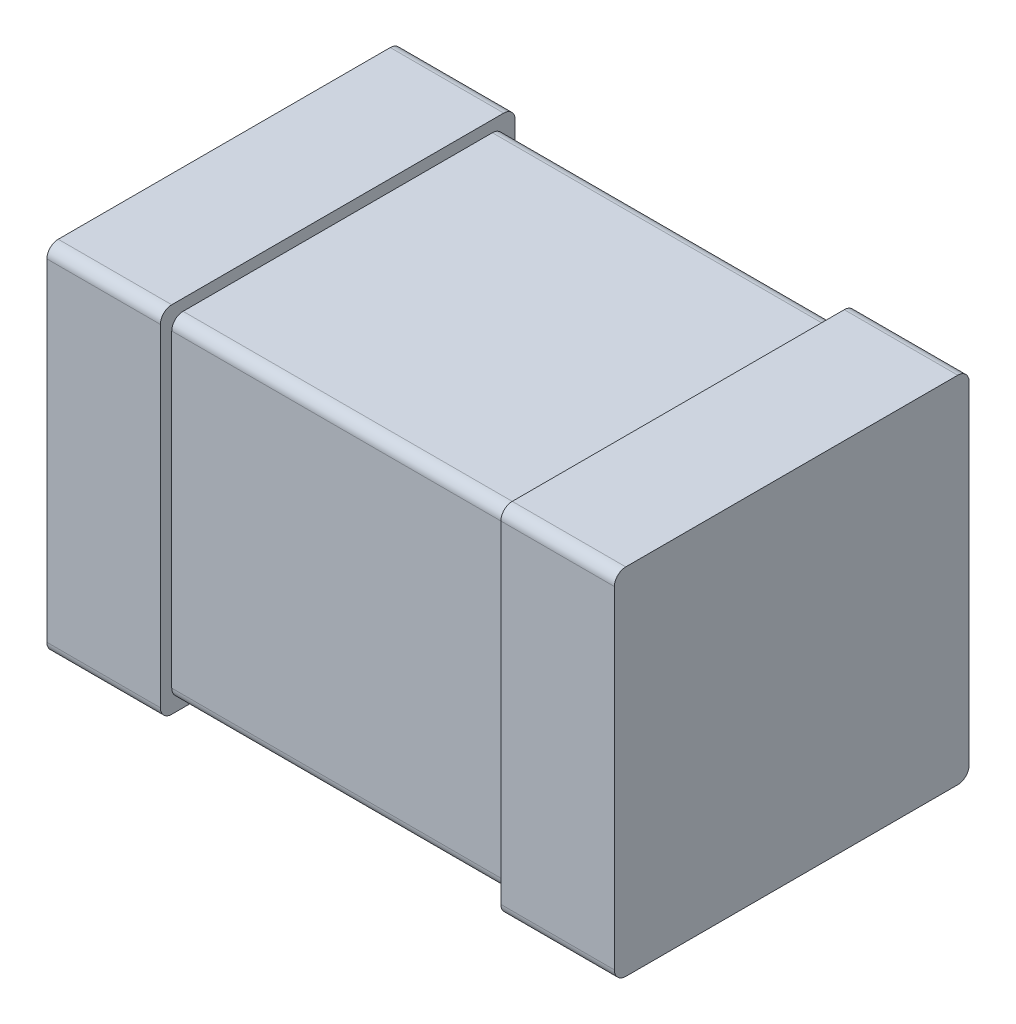
ISO-10303-21;
HEADER;
FILE_DESCRIPTION(('STEP AP214'),'2;1');
FILE_NAME('part.step','',(''),(''),'','','');
FILE_SCHEMA(('AUTOMOTIVE_DESIGN { 1 0 10303 214 1 1 1 1 }'));
ENDSEC;
DATA;
#1=APPLICATION_CONTEXT('core data for automotive mechanical design processes');
#2=APPLICATION_PROTOCOL_DEFINITION('international standard','automotive_design',2000,#1);
#3=PRODUCT_CONTEXT('',#1,'mechanical');
#4=PRODUCT('Part','Part','',(#3));
#5=PRODUCT_RELATED_PRODUCT_CATEGORY('part','',(#4));
#6=PRODUCT_DEFINITION_FORMATION('','',#4);
#7=PRODUCT_DEFINITION_CONTEXT('part definition',#1,'design');
#8=PRODUCT_DEFINITION('design','',#6,#7);
#9=PRODUCT_DEFINITION_SHAPE('','',#8);
#10=(LENGTH_UNIT() NAMED_UNIT(*) SI_UNIT(.MILLI.,.METRE.));
#11=(NAMED_UNIT(*) PLANE_ANGLE_UNIT() SI_UNIT($,.RADIAN.));
#12=(NAMED_UNIT(*) SI_UNIT($,.STERADIAN.) SOLID_ANGLE_UNIT());
#13=UNCERTAINTY_MEASURE_WITH_UNIT(LENGTH_MEASURE(1.E-05),#10,'distance_accuracy_value','');
#14=(GEOMETRIC_REPRESENTATION_CONTEXT(3) GLOBAL_UNCERTAINTY_ASSIGNED_CONTEXT((#13)) GLOBAL_UNIT_ASSIGNED_CONTEXT((#10,
#11,#12)) REPRESENTATION_CONTEXT('',''));
#15=CARTESIAN_POINT('',(0.,0.,0.));
#16=DIRECTION('',(0.,0.,1.));
#17=DIRECTION('',(1.,0.,0.));
#18=AXIS2_PLACEMENT_3D('',#15,#16,#17);
#19=CARTESIAN_POINT('',(1.,-0.625,0.));
#20=DIRECTION('',(1.,0.,0.));
#21=DIRECTION('',(0.,1.,0.));
#22=AXIS2_PLACEMENT_3D('',#19,#20,#21);
#23=PLANE('',#22);
#24=DIRECTION('',(0.,0.,1.));
#25=VECTOR('',#24,1.);
#26=CARTESIAN_POINT('',(1.,-0.625,0.));
#27=LINE('',#26,#25);
#28=CARTESIAN_POINT('',(1.,-0.625,0.04));
#29=VERTEX_POINT('',#28);
#30=CARTESIAN_POINT('',(1.,-0.625,1.21));
#31=VERTEX_POINT('',#30);
#32=EDGE_CURVE('E185',#29,#31,#27,.T.);
#33=ORIENTED_EDGE('',*,*,#32,.F.);
#34=CARTESIAN_POINT('',(1.,-0.585,0.04));
#35=DIRECTION('',(1.,0.,0.));
#36=DIRECTION('',(0.,0.,1.));
#37=AXIS2_PLACEMENT_3D('',#34,#35,#36);
#38=CIRCLE('',#37,0.04);
#39=CARTESIAN_POINT('',(1.,-0.585,0.));
#40=VERTEX_POINT('',#39);
#41=EDGE_CURVE('E173',#29,#40,#38,.T.);
#42=ORIENTED_EDGE('',*,*,#41,.T.);
#43=DIRECTION('',(0.,1.,0.));
#44=VECTOR('',#43,1.);
#45=CARTESIAN_POINT('',(1.,-0.625,0.));
#46=LINE('',#45,#44);
#47=CARTESIAN_POINT('',(1.,0.585,0.));
#48=VERTEX_POINT('',#47);
#49=EDGE_CURVE('E119',#40,#48,#46,.T.);
#50=ORIENTED_EDGE('',*,*,#49,.T.);
#51=CARTESIAN_POINT('',(1.,0.585,0.04));
#52=DIRECTION('',(-1.,0.,0.));
#53=DIRECTION('',(0.,0.,1.));
#54=AXIS2_PLACEMENT_3D('',#51,#52,#53);
#55=CIRCLE('',#54,0.04);
#56=CARTESIAN_POINT('',(1.,0.625,0.04));
#57=VERTEX_POINT('',#56);
#58=EDGE_CURVE('E103',#57,#48,#55,.T.);
#59=ORIENTED_EDGE('',*,*,#58,.F.);
#60=DIRECTION('',(0.,0.,1.));
#61=VECTOR('',#60,1.);
#62=CARTESIAN_POINT('',(1.,0.625,0.));
#63=LINE('',#62,#61);
#64=CARTESIAN_POINT('',(1.,0.625,1.21));
#65=VERTEX_POINT('',#64);
#66=EDGE_CURVE('E11',#57,#65,#63,.T.);
#67=ORIENTED_EDGE('',*,*,#66,.T.);
#68=CARTESIAN_POINT('',(1.,0.585,1.21));
#69=DIRECTION('',(1.,0.,0.));
#70=DIRECTION('',(0.,0.,1.));
#71=AXIS2_PLACEMENT_3D('',#68,#69,#70);
#72=CIRCLE('',#71,0.04);
#73=CARTESIAN_POINT('',(1.,0.585,1.25));
#74=VERTEX_POINT('',#73);
#75=EDGE_CURVE('E20',#65,#74,#72,.T.);
#76=ORIENTED_EDGE('',*,*,#75,.T.);
#77=DIRECTION('',(0.,1.,0.));
#78=VECTOR('',#77,1.);
#79=CARTESIAN_POINT('',(1.,-0.625,1.25));
#80=LINE('',#79,#78);
#81=CARTESIAN_POINT('',(1.,-0.585,1.25));
#82=VERTEX_POINT('',#81);
#83=EDGE_CURVE('E99',#82,#74,#80,.T.);
#84=ORIENTED_EDGE('',*,*,#83,.F.);
#85=CARTESIAN_POINT('',(1.,-0.585,1.21));
#86=DIRECTION('',(-1.,0.,0.));
#87=DIRECTION('',(0.,0.,1.));
#88=AXIS2_PLACEMENT_3D('',#85,#86,#87);
#89=CIRCLE('',#88,0.04);
#90=EDGE_CURVE('E170',#31,#82,#89,.T.);
#91=ORIENTED_EDGE('',*,*,#90,.F.);
#92=EDGE_LOOP('',(#33,#42,#50,#59,#67,#76,#84,#91));
#93=FACE_BOUND('',#92,.T.);
#94=ADVANCED_FACE('F17',(#93),#23,.T.);
#95=CARTESIAN_POINT('',(0.6,0.625,0.));
#96=DIRECTION('',(0.,1.,0.));
#97=DIRECTION('',(1.,0.,0.));
#98=AXIS2_PLACEMENT_3D('',#95,#96,#97);
#99=PLANE('',#98);
#100=ORIENTED_EDGE('',*,*,#66,.F.);
#101=DIRECTION('',(1.,0.,0.));
#102=VECTOR('',#101,1.);
#103=CARTESIAN_POINT('',(0.6,0.625,0.04));
#104=LINE('',#103,#102);
#105=CARTESIAN_POINT('',(0.6,0.625,0.04));
#106=VERTEX_POINT('',#105);
#107=EDGE_CURVE('E113',#106,#57,#104,.T.);
#108=ORIENTED_EDGE('',*,*,#107,.F.);
#109=DIRECTION('',(0.,0.,1.));
#110=VECTOR('',#109,1.);
#111=CARTESIAN_POINT('',(0.6,0.625,0.));
#112=LINE('',#111,#110);
#113=CARTESIAN_POINT('',(0.6,0.625,1.21));
#114=VERTEX_POINT('',#113);
#115=EDGE_CURVE('E156',#106,#114,#112,.T.);
#116=ORIENTED_EDGE('',*,*,#115,.T.);
#117=DIRECTION('',(1.,0.,0.));
#118=VECTOR('',#117,1.);
#119=CARTESIAN_POINT('',(0.6,0.625,1.21));
#120=LINE('',#119,#118);
#121=EDGE_CURVE('E27',#114,#65,#120,.T.);
#122=ORIENTED_EDGE('',*,*,#121,.T.);
#123=EDGE_LOOP('',(#100,#108,#116,#122));
#124=FACE_BOUND('',#123,.T.);
#125=ADVANCED_FACE('F584',(#124),#99,.T.);
#126=CARTESIAN_POINT('',(0.6,0.585,1.21));
#127=DIRECTION('',(1.,0.,0.));
#128=DIRECTION('',(0.,1.,0.));
#129=AXIS2_PLACEMENT_3D('',#126,#127,#128);
#130=CYLINDRICAL_SURFACE('',#129,0.04);
#131=CARTESIAN_POINT('',(0.6,0.585,1.21));
#132=DIRECTION('',(1.,0.,0.));
#133=DIRECTION('',(0.,0.,1.));
#134=AXIS2_PLACEMENT_3D('',#131,#132,#133);
#135=CIRCLE('',#134,0.04);
#136=CARTESIAN_POINT('',(0.6,0.585,1.25));
#137=VERTEX_POINT('',#136);
#138=EDGE_CURVE('E108',#114,#137,#135,.T.);
#139=ORIENTED_EDGE('',*,*,#138,.T.);
#140=DIRECTION('',(1.,0.,0.));
#141=VECTOR('',#140,1.);
#142=CARTESIAN_POINT('',(0.6,0.585,1.25));
#143=LINE('',#142,#141);
#144=EDGE_CURVE('E105',#137,#74,#143,.T.);
#145=ORIENTED_EDGE('',*,*,#144,.T.);
#146=ORIENTED_EDGE('',*,*,#75,.F.);
#147=ORIENTED_EDGE('',*,*,#121,.F.);
#148=EDGE_LOOP('',(#139,#145,#146,#147));
#149=FACE_BOUND('',#148,.T.);
#150=ADVANCED_FACE('F106',(#149),#130,.T.);
#151=CARTESIAN_POINT('',(0.6,0.585,0.04));
#152=DIRECTION('',(1.,0.,0.));
#153=DIRECTION('',(0.,1.,0.));
#154=AXIS2_PLACEMENT_3D('',#151,#152,#153);
#155=CYLINDRICAL_SURFACE('',#154,0.04);
#156=ORIENTED_EDGE('',*,*,#107,.T.);
#157=ORIENTED_EDGE('',*,*,#58,.T.);
#158=DIRECTION('',(1.,0.,0.));
#159=VECTOR('',#158,1.);
#160=CARTESIAN_POINT('',(0.6,0.585,0.));
#161=LINE('',#160,#159);
#162=CARTESIAN_POINT('',(0.6,0.585,0.));
#163=VERTEX_POINT('',#162);
#164=EDGE_CURVE('E126',#163,#48,#161,.T.);
#165=ORIENTED_EDGE('',*,*,#164,.F.);
#166=CARTESIAN_POINT('',(0.6,0.585,0.04));
#167=DIRECTION('',(-1.,0.,0.));
#168=DIRECTION('',(0.,0.,1.));
#169=AXIS2_PLACEMENT_3D('',#166,#167,#168);
#170=CIRCLE('',#169,0.04);
#171=EDGE_CURVE('E160',#106,#163,#170,.T.);
#172=ORIENTED_EDGE('',*,*,#171,.F.);
#173=EDGE_LOOP('',(#156,#157,#165,#172));
#174=FACE_BOUND('',#173,.T.);
#175=ADVANCED_FACE('F592',(#174),#155,.T.);
#176=CARTESIAN_POINT('',(0.6,-0.625,1.25));
#177=DIRECTION('',(0.,0.,1.));
#178=DIRECTION('',(1.,0.,0.));
#179=AXIS2_PLACEMENT_3D('',#176,#177,#178);
#180=PLANE('',#179);
#181=DIRECTION('',(0.,1.,0.));
#182=VECTOR('',#181,1.);
#183=CARTESIAN_POINT('',(0.6,-0.625,1.25));
#184=LINE('',#183,#182);
#185=CARTESIAN_POINT('',(0.6,-0.585,1.25));
#186=VERTEX_POINT('',#185);
#187=EDGE_CURVE('E267',#186,#137,#184,.T.);
#188=ORIENTED_EDGE('',*,*,#187,.F.);
#189=DIRECTION('',(1.,0.,0.));
#190=VECTOR('',#189,1.);
#191=CARTESIAN_POINT('',(0.6,-0.585,1.25));
#192=LINE('',#191,#190);
#193=EDGE_CURVE('E116',#186,#82,#192,.T.);
#194=ORIENTED_EDGE('',*,*,#193,.T.);
#195=ORIENTED_EDGE('',*,*,#83,.T.);
#196=ORIENTED_EDGE('',*,*,#144,.F.);
#197=EDGE_LOOP('',(#188,#194,#195,#196));
#198=FACE_BOUND('',#197,.T.);
#199=ADVANCED_FACE('F115',(#198),#180,.T.);
#200=CARTESIAN_POINT('',(0.6,-0.625,0.));
#201=DIRECTION('',(0.,0.,1.));
#202=DIRECTION('',(1.,0.,0.));
#203=AXIS2_PLACEMENT_3D('',#200,#201,#202);
#204=PLANE('',#203);
#205=ORIENTED_EDGE('',*,*,#164,.T.);
#206=ORIENTED_EDGE('',*,*,#49,.F.);
#207=DIRECTION('',(1.,0.,0.));
#208=VECTOR('',#207,1.);
#209=CARTESIAN_POINT('',(0.6,-0.585,0.));
#210=LINE('',#209,#208);
#211=CARTESIAN_POINT('',(0.6,-0.585,0.));
#212=VERTEX_POINT('',#211);
#213=EDGE_CURVE('E189',#212,#40,#210,.T.);
#214=ORIENTED_EDGE('',*,*,#213,.F.);
#215=DIRECTION('',(0.,1.,0.));
#216=VECTOR('',#215,1.);
#217=CARTESIAN_POINT('',(0.6,-0.625,0.));
#218=LINE('',#217,#216);
#219=EDGE_CURVE('E161',#212,#163,#218,.T.);
#220=ORIENTED_EDGE('',*,*,#219,.T.);
#221=EDGE_LOOP('',(#205,#206,#214,#220));
#222=FACE_BOUND('',#221,.T.);
#223=ADVANCED_FACE('F597',(#222),#204,.F.);
#224=CARTESIAN_POINT('',(0.6,-0.585,1.21));
#225=DIRECTION('',(1.,0.,0.));
#226=DIRECTION('',(0.,-1.,0.));
#227=AXIS2_PLACEMENT_3D('',#224,#225,#226);
#228=CYLINDRICAL_SURFACE('',#227,0.04);
#229=DIRECTION('',(1.,0.,0.));
#230=VECTOR('',#229,1.);
#231=CARTESIAN_POINT('',(0.6,-0.625,1.21));
#232=LINE('',#231,#230);
#233=CARTESIAN_POINT('',(0.6,-0.625,1.21));
#234=VERTEX_POINT('',#233);
#235=EDGE_CURVE('E177',#234,#31,#232,.T.);
#236=ORIENTED_EDGE('',*,*,#235,.T.);
#237=ORIENTED_EDGE('',*,*,#90,.T.);
#238=ORIENTED_EDGE('',*,*,#193,.F.);
#239=CARTESIAN_POINT('',(0.6,-0.585,1.21));
#240=DIRECTION('',(-1.,0.,0.));
#241=DIRECTION('',(0.,0.,1.));
#242=AXIS2_PLACEMENT_3D('',#239,#240,#241);
#243=CIRCLE('',#242,0.04);
#244=EDGE_CURVE('E215',#234,#186,#243,.T.);
#245=ORIENTED_EDGE('',*,*,#244,.F.);
#246=EDGE_LOOP('',(#236,#237,#238,#245));
#247=FACE_BOUND('',#246,.T.);
#248=ADVANCED_FACE('F604',(#247),#228,.T.);
#249=CARTESIAN_POINT('',(0.6,-0.585,0.04));
#250=DIRECTION('',(1.,0.,0.));
#251=DIRECTION('',(0.,-1.,0.));
#252=AXIS2_PLACEMENT_3D('',#249,#250,#251);
#253=CYLINDRICAL_SURFACE('',#252,0.04);
#254=CARTESIAN_POINT('',(0.6,-0.585,0.04));
#255=DIRECTION('',(1.,0.,0.));
#256=DIRECTION('',(0.,0.,1.));
#257=AXIS2_PLACEMENT_3D('',#254,#255,#256);
#258=CIRCLE('',#257,0.04);
#259=CARTESIAN_POINT('',(0.6,-0.625,0.04));
#260=VERTEX_POINT('',#259);
#261=EDGE_CURVE('E165',#260,#212,#258,.T.);
#262=ORIENTED_EDGE('',*,*,#261,.T.);
#263=ORIENTED_EDGE('',*,*,#213,.T.);
#264=ORIENTED_EDGE('',*,*,#41,.F.);
#265=DIRECTION('',(1.,0.,0.));
#266=VECTOR('',#265,1.);
#267=CARTESIAN_POINT('',(0.6,-0.625,0.04));
#268=LINE('',#267,#266);
#269=EDGE_CURVE('E181',#260,#29,#268,.T.);
#270=ORIENTED_EDGE('',*,*,#269,.F.);
#271=EDGE_LOOP('',(#262,#263,#264,#270));
#272=FACE_BOUND('',#271,.T.);
#273=ADVANCED_FACE('F600',(#272),#253,.T.);
#274=CARTESIAN_POINT('',(0.6,-0.625,0.));
#275=DIRECTION('',(0.,1.,0.));
#276=DIRECTION('',(1.,0.,0.));
#277=AXIS2_PLACEMENT_3D('',#274,#275,#276);
#278=PLANE('',#277);
#279=ORIENTED_EDGE('',*,*,#235,.F.);
#280=DIRECTION('',(0.,0.,1.));
#281=VECTOR('',#280,1.);
#282=CARTESIAN_POINT('',(0.6,-0.625,0.));
#283=LINE('',#282,#281);
#284=EDGE_CURVE('E169',#260,#234,#283,.T.);
#285=ORIENTED_EDGE('',*,*,#284,.F.);
#286=ORIENTED_EDGE('',*,*,#269,.T.);
#287=ORIENTED_EDGE('',*,*,#32,.T.);
#288=EDGE_LOOP('',(#279,#285,#286,#287));
#289=FACE_BOUND('',#288,.T.);
#290=ADVANCED_FACE('F603',(#289),#278,.F.);
#291=CARTESIAN_POINT('',(0.6,-0.625,0.));
#292=DIRECTION('',(1.,0.,0.));
#293=DIRECTION('',(0.,1.,0.));
#294=AXIS2_PLACEMENT_3D('',#291,#292,#293);
#295=PLANE('',#294);
#296=DIRECTION('',(0.,1.,0.));
#297=VECTOR('',#296,1.);
#298=CARTESIAN_POINT('',(0.6,-0.585,0.04));
#299=LINE('',#298,#297);
#300=CARTESIAN_POINT('',(0.6,-0.545,0.04));
#301=VERTEX_POINT('',#300);
#302=CARTESIAN_POINT('',(0.6,0.545,0.04));
#303=VERTEX_POINT('',#302);
#304=EDGE_CURVE('E130',#301,#303,#299,.T.);
#305=ORIENTED_EDGE('',*,*,#304,.T.);
#306=CARTESIAN_POINT('',(0.6,0.545,0.08));
#307=DIRECTION('',(-1.,0.,0.));
#308=DIRECTION('',(0.,0.,1.));
#309=AXIS2_PLACEMENT_3D('',#306,#307,#308);
#310=CIRCLE('',#309,0.04);
#311=CARTESIAN_POINT('',(0.6,0.585,0.08));
#312=VERTEX_POINT('',#311);
#313=EDGE_CURVE('E135',#312,#303,#310,.T.);
#314=ORIENTED_EDGE('',*,*,#313,.F.);
#315=DIRECTION('',(0.,0.,1.));
#316=VECTOR('',#315,1.);
#317=CARTESIAN_POINT('',(0.6,0.585,0.04));
#318=LINE('',#317,#316);
#319=CARTESIAN_POINT('',(0.6,0.585,1.17));
#320=VERTEX_POINT('',#319);
#321=EDGE_CURVE('E233',#312,#320,#318,.T.);
#322=ORIENTED_EDGE('',*,*,#321,.T.);
#323=CARTESIAN_POINT('',(0.6,0.545,1.17));
#324=DIRECTION('',(1.,0.,0.));
#325=DIRECTION('',(0.,0.,1.));
#326=AXIS2_PLACEMENT_3D('',#323,#324,#325);
#327=CIRCLE('',#326,0.04);
#328=CARTESIAN_POINT('',(0.6,0.545,1.21));
#329=VERTEX_POINT('',#328);
#330=EDGE_CURVE('E140',#320,#329,#327,.T.);
#331=ORIENTED_EDGE('',*,*,#330,.T.);
#332=DIRECTION('',(0.,1.,0.));
#333=VECTOR('',#332,1.);
#334=CARTESIAN_POINT('',(0.6,-0.585,1.21));
#335=LINE('',#334,#333);
#336=CARTESIAN_POINT('',(0.6,-0.545,1.21));
#337=VERTEX_POINT('',#336);
#338=EDGE_CURVE('E142',#337,#329,#335,.T.);
#339=ORIENTED_EDGE('',*,*,#338,.F.);
#340=CARTESIAN_POINT('',(0.6,-0.545,1.17));
#341=DIRECTION('',(-1.,0.,0.));
#342=DIRECTION('',(0.,0.,1.));
#343=AXIS2_PLACEMENT_3D('',#340,#341,#342);
#344=CIRCLE('',#343,0.04);
#345=CARTESIAN_POINT('',(0.6,-0.585,1.17));
#346=VERTEX_POINT('',#345);
#347=EDGE_CURVE('E151',#346,#337,#344,.T.);
#348=ORIENTED_EDGE('',*,*,#347,.F.);
#349=DIRECTION('',(0.,0.,1.));
#350=VECTOR('',#349,1.);
#351=CARTESIAN_POINT('',(0.6,-0.585,0.04));
#352=LINE('',#351,#350);
#353=CARTESIAN_POINT('',(0.6,-0.585,0.08));
#354=VERTEX_POINT('',#353);
#355=EDGE_CURVE('E155',#354,#346,#352,.T.);
#356=ORIENTED_EDGE('',*,*,#355,.F.);
#357=CARTESIAN_POINT('',(0.6,-0.545,0.08));
#358=DIRECTION('',(1.,0.,0.));
#359=DIRECTION('',(0.,0.,1.));
#360=AXIS2_PLACEMENT_3D('',#357,#358,#359);
#361=CIRCLE('',#360,0.04);
#362=EDGE_CURVE('E283',#354,#301,#361,.T.);
#363=ORIENTED_EDGE('',*,*,#362,.T.);
#364=EDGE_LOOP('',(#305,#314,#322,#331,#339,#348,#356,#363));
#365=FACE_BOUND('',#364,.T.);
#366=ORIENTED_EDGE('',*,*,#244,.T.);
#367=ORIENTED_EDGE('',*,*,#187,.T.);
#368=ORIENTED_EDGE('',*,*,#138,.F.);
#369=ORIENTED_EDGE('',*,*,#115,.F.);
#370=ORIENTED_EDGE('',*,*,#171,.T.);
#371=ORIENTED_EDGE('',*,*,#219,.F.);
#372=ORIENTED_EDGE('',*,*,#261,.F.);
#373=ORIENTED_EDGE('',*,*,#284,.T.);
#374=EDGE_LOOP('',(#366,#367,#368,#369,#370,#371,#372,#373));
#375=FACE_BOUND('',#374,.T.);
#376=ADVANCED_FACE('F313',(#365,#375),#295,.F.);
#377=CARTESIAN_POINT('',(-0.6,-0.585,0.04));
#378=DIRECTION('',(0.,1.,0.));
#379=DIRECTION('',(1.,0.,0.));
#380=AXIS2_PLACEMENT_3D('',#377,#378,#379);
#381=PLANE('',#380);
#382=DIRECTION('',(1.,0.,0.));
#383=VECTOR('',#382,1.);
#384=CARTESIAN_POINT('',(-0.6,-0.585,1.17));
#385=LINE('',#384,#383);
#386=CARTESIAN_POINT('',(-0.6,-0.585,1.17));
#387=VERTEX_POINT('',#386);
#388=EDGE_CURVE('E146',#387,#346,#385,.T.);
#389=ORIENTED_EDGE('',*,*,#388,.F.);
#390=DIRECTION('',(0.,0.,1.));
#391=VECTOR('',#390,1.);
#392=CARTESIAN_POINT('',(-0.6,-0.585,0.04));
#393=LINE('',#392,#391);
#394=CARTESIAN_POINT('',(-0.6,-0.585,0.08));
#395=VERTEX_POINT('',#394);
#396=EDGE_CURVE('E253',#395,#387,#393,.T.);
#397=ORIENTED_EDGE('',*,*,#396,.F.);
#398=DIRECTION('',(1.,0.,0.));
#399=VECTOR('',#398,1.);
#400=CARTESIAN_POINT('',(-0.6,-0.585,0.08));
#401=LINE('',#400,#399);
#402=EDGE_CURVE('E284',#395,#354,#401,.T.);
#403=ORIENTED_EDGE('',*,*,#402,.T.);
#404=ORIENTED_EDGE('',*,*,#355,.T.);
#405=EDGE_LOOP('',(#389,#397,#403,#404));
#406=FACE_BOUND('',#405,.T.);
#407=ADVANCED_FACE('F431',(#406),#381,.F.);
#408=CARTESIAN_POINT('',(-0.6,-0.545,1.17));
#409=DIRECTION('',(1.,0.,0.));
#410=DIRECTION('',(0.,-1.,0.));
#411=AXIS2_PLACEMENT_3D('',#408,#409,#410);
#412=CYLINDRICAL_SURFACE('',#411,0.04);
#413=ORIENTED_EDGE('',*,*,#388,.T.);
#414=ORIENTED_EDGE('',*,*,#347,.T.);
#415=DIRECTION('',(1.,0.,0.));
#416=VECTOR('',#415,1.);
#417=CARTESIAN_POINT('',(-0.6,-0.545,1.21));
#418=LINE('',#417,#416);
#419=CARTESIAN_POINT('',(-0.6,-0.545,1.21));
#420=VERTEX_POINT('',#419);
#421=EDGE_CURVE('E147',#420,#337,#418,.T.);
#422=ORIENTED_EDGE('',*,*,#421,.F.);
#423=CARTESIAN_POINT('',(-0.6,-0.545,1.17));
#424=DIRECTION('',(-1.,0.,0.));
#425=DIRECTION('',(0.,0.,1.));
#426=AXIS2_PLACEMENT_3D('',#423,#424,#425);
#427=CIRCLE('',#426,0.04);
#428=EDGE_CURVE('E257',#387,#420,#427,.T.);
#429=ORIENTED_EDGE('',*,*,#428,.F.);
#430=EDGE_LOOP('',(#413,#414,#422,#429));
#431=FACE_BOUND('',#430,.T.);
#432=ADVANCED_FACE('F429',(#431),#412,.T.);
#433=CARTESIAN_POINT('',(-0.6,-0.585,1.21));
#434=DIRECTION('',(0.,0.,1.));
#435=DIRECTION('',(1.,0.,0.));
#436=AXIS2_PLACEMENT_3D('',#433,#434,#435);
#437=PLANE('',#436);
#438=DIRECTION('',(0.,1.,0.));
#439=VECTOR('',#438,1.);
#440=CARTESIAN_POINT('',(-0.6,-0.585,1.21));
#441=LINE('',#440,#439);
#442=CARTESIAN_POINT('',(-0.6,0.545,1.21));
#443=VERTEX_POINT('',#442);
#444=EDGE_CURVE('E246',#420,#443,#441,.T.);
#445=ORIENTED_EDGE('',*,*,#444,.F.);
#446=ORIENTED_EDGE('',*,*,#421,.T.);
#447=ORIENTED_EDGE('',*,*,#338,.T.);
#448=DIRECTION('',(1.,0.,0.));
#449=VECTOR('',#448,1.);
#450=CARTESIAN_POINT('',(-0.6,0.545,1.21));
#451=LINE('',#450,#449);
#452=EDGE_CURVE('E136',#443,#329,#451,.T.);
#453=ORIENTED_EDGE('',*,*,#452,.F.);
#454=EDGE_LOOP('',(#445,#446,#447,#453));
#455=FACE_BOUND('',#454,.T.);
#456=ADVANCED_FACE('F423',(#455),#437,.T.);
#457=CARTESIAN_POINT('',(-0.6,0.545,1.17));
#458=DIRECTION('',(1.,0.,0.));
#459=DIRECTION('',(0.,1.,0.));
#460=AXIS2_PLACEMENT_3D('',#457,#458,#459);
#461=CYLINDRICAL_SURFACE('',#460,0.04);
#462=CARTESIAN_POINT('',(-0.6,0.545,1.17));
#463=DIRECTION('',(1.,0.,0.));
#464=DIRECTION('',(0.,0.,1.));
#465=AXIS2_PLACEMENT_3D('',#462,#463,#464);
#466=CIRCLE('',#465,0.04);
#467=CARTESIAN_POINT('',(-0.6,0.585,1.17));
#468=VERTEX_POINT('',#467);
#469=EDGE_CURVE('E241',#468,#443,#466,.T.);
#470=ORIENTED_EDGE('',*,*,#469,.T.);
#471=ORIENTED_EDGE('',*,*,#452,.T.);
#472=ORIENTED_EDGE('',*,*,#330,.F.);
#473=DIRECTION('',(1.,0.,0.));
#474=VECTOR('',#473,1.);
#475=CARTESIAN_POINT('',(-0.6,0.585,1.17));
#476=LINE('',#475,#474);
#477=EDGE_CURVE('E141',#468,#320,#476,.T.);
#478=ORIENTED_EDGE('',*,*,#477,.F.);
#479=EDGE_LOOP('',(#470,#471,#472,#478));
#480=FACE_BOUND('',#479,.T.);
#481=ADVANCED_FACE('F425',(#480),#461,.T.);
#482=CARTESIAN_POINT('',(-0.6,0.585,0.04));
#483=DIRECTION('',(0.,1.,0.));
#484=DIRECTION('',(1.,0.,0.));
#485=AXIS2_PLACEMENT_3D('',#482,#483,#484);
#486=PLANE('',#485);
#487=ORIENTED_EDGE('',*,*,#321,.F.);
#488=DIRECTION('',(1.,0.,0.));
#489=VECTOR('',#488,1.);
#490=CARTESIAN_POINT('',(-0.6,0.585,0.08));
#491=LINE('',#490,#489);
#492=CARTESIAN_POINT('',(-0.6,0.585,0.08));
#493=VERTEX_POINT('',#492);
#494=EDGE_CURVE('E132',#493,#312,#491,.T.);
#495=ORIENTED_EDGE('',*,*,#494,.F.);
#496=DIRECTION('',(0.,0.,1.));
#497=VECTOR('',#496,1.);
#498=CARTESIAN_POINT('',(-0.6,0.585,0.04));
#499=LINE('',#498,#497);
#500=EDGE_CURVE('E245',#493,#468,#499,.T.);
#501=ORIENTED_EDGE('',*,*,#500,.T.);
#502=ORIENTED_EDGE('',*,*,#477,.T.);
#503=EDGE_LOOP('',(#487,#495,#501,#502));
#504=FACE_BOUND('',#503,.T.);
#505=ADVANCED_FACE('F617',(#504),#486,.T.);
#506=CARTESIAN_POINT('',(-0.6,0.545,0.08));
#507=DIRECTION('',(1.,0.,0.));
#508=DIRECTION('',(0.,1.,0.));
#509=AXIS2_PLACEMENT_3D('',#506,#507,#508);
#510=CYLINDRICAL_SURFACE('',#509,0.04);
#511=ORIENTED_EDGE('',*,*,#494,.T.);
#512=ORIENTED_EDGE('',*,*,#313,.T.);
#513=DIRECTION('',(1.,0.,0.));
#514=VECTOR('',#513,1.);
#515=CARTESIAN_POINT('',(-0.6,0.545,0.04));
#516=LINE('',#515,#514);
#517=CARTESIAN_POINT('',(-0.6,0.545,0.04));
#518=VERTEX_POINT('',#517);
#519=EDGE_CURVE('E288',#518,#303,#516,.T.);
#520=ORIENTED_EDGE('',*,*,#519,.F.);
#521=CARTESIAN_POINT('',(-0.6,0.545,0.08));
#522=DIRECTION('',(-1.,0.,0.));
#523=DIRECTION('',(0.,0.,1.));
#524=AXIS2_PLACEMENT_3D('',#521,#522,#523);
#525=CIRCLE('',#524,0.04);
#526=EDGE_CURVE('E271',#493,#518,#525,.T.);
#527=ORIENTED_EDGE('',*,*,#526,.F.);
#528=EDGE_LOOP('',(#511,#512,#520,#527));
#529=FACE_BOUND('',#528,.T.);
#530=ADVANCED_FACE('F302',(#529),#510,.T.);
#531=CARTESIAN_POINT('',(-0.6,-0.585,0.04));
#532=DIRECTION('',(0.,0.,1.));
#533=DIRECTION('',(1.,0.,0.));
#534=AXIS2_PLACEMENT_3D('',#531,#532,#533);
#535=PLANE('',#534);
#536=ORIENTED_EDGE('',*,*,#519,.T.);
#537=ORIENTED_EDGE('',*,*,#304,.F.);
#538=DIRECTION('',(1.,0.,0.));
#539=VECTOR('',#538,1.);
#540=CARTESIAN_POINT('',(-0.6,-0.545,0.04));
#541=LINE('',#540,#539);
#542=CARTESIAN_POINT('',(-0.6,-0.545,0.04));
#543=VERTEX_POINT('',#542);
#544=EDGE_CURVE('E279',#543,#301,#541,.T.);
#545=ORIENTED_EDGE('',*,*,#544,.F.);
#546=DIRECTION('',(0.,1.,0.));
#547=VECTOR('',#546,1.);
#548=CARTESIAN_POINT('',(-0.6,-0.585,0.04));
#549=LINE('',#548,#547);
#550=EDGE_CURVE('E275',#543,#518,#549,.T.);
#551=ORIENTED_EDGE('',*,*,#550,.T.);
#552=EDGE_LOOP('',(#536,#537,#545,#551));
#553=FACE_BOUND('',#552,.T.);
#554=ADVANCED_FACE('F320',(#553),#535,.F.);
#555=CARTESIAN_POINT('',(-0.6,-0.545,0.08));
#556=DIRECTION('',(1.,0.,0.));
#557=DIRECTION('',(0.,-1.,0.));
#558=AXIS2_PLACEMENT_3D('',#555,#556,#557);
#559=CYLINDRICAL_SURFACE('',#558,0.04);
#560=CARTESIAN_POINT('',(-0.6,-0.545,0.08));
#561=DIRECTION('',(1.,0.,0.));
#562=DIRECTION('',(0.,0.,1.));
#563=AXIS2_PLACEMENT_3D('',#560,#561,#562);
#564=CIRCLE('',#563,0.04);
#565=EDGE_CURVE('E258',#395,#543,#564,.T.);
#566=ORIENTED_EDGE('',*,*,#565,.T.);
#567=ORIENTED_EDGE('',*,*,#544,.T.);
#568=ORIENTED_EDGE('',*,*,#362,.F.);
#569=ORIENTED_EDGE('',*,*,#402,.F.);
#570=EDGE_LOOP('',(#566,#567,#568,#569));
#571=FACE_BOUND('',#570,.T.);
#572=ADVANCED_FACE('F627',(#571),#559,.T.);
#573=CARTESIAN_POINT('',(-0.6,-0.625,0.));
#574=DIRECTION('',(1.,0.,0.));
#575=DIRECTION('',(0.,1.,0.));
#576=AXIS2_PLACEMENT_3D('',#573,#574,#575);
#577=PLANE('',#576);
#578=ORIENTED_EDGE('',*,*,#565,.F.);
#579=ORIENTED_EDGE('',*,*,#396,.T.);
#580=ORIENTED_EDGE('',*,*,#428,.T.);
#581=ORIENTED_EDGE('',*,*,#444,.T.);
#582=ORIENTED_EDGE('',*,*,#469,.F.);
#583=ORIENTED_EDGE('',*,*,#500,.F.);
#584=ORIENTED_EDGE('',*,*,#526,.T.);
#585=ORIENTED_EDGE('',*,*,#550,.F.);
#586=EDGE_LOOP('',(#578,#579,#580,#581,#582,#583,#584,#585));
#587=FACE_BOUND('',#586,.T.);
#588=DIRECTION('',(0.,0.,1.));
#589=VECTOR('',#588,1.);
#590=CARTESIAN_POINT('',(-0.6,-0.625,0.));
#591=LINE('',#590,#589);
#592=CARTESIAN_POINT('',(-0.6,-0.625,0.04));
#593=VERTEX_POINT('',#592);
#594=CARTESIAN_POINT('',(-0.6,-0.625,1.21));
#595=VERTEX_POINT('',#594);
#596=EDGE_CURVE('E448',#593,#595,#591,.T.);
#597=ORIENTED_EDGE('',*,*,#596,.F.);
#598=CARTESIAN_POINT('',(-0.6,-0.585,0.04));
#599=DIRECTION('',(1.,0.,0.));
#600=DIRECTION('',(0.,0.,1.));
#601=AXIS2_PLACEMENT_3D('',#598,#599,#600);
#602=CIRCLE('',#601,0.04);
#603=CARTESIAN_POINT('',(-0.6,-0.585,0.));
#604=VERTEX_POINT('',#603);
#605=EDGE_CURVE('E447',#593,#604,#602,.T.);
#606=ORIENTED_EDGE('',*,*,#605,.T.);
#607=DIRECTION('',(0.,1.,0.));
#608=VECTOR('',#607,1.);
#609=CARTESIAN_POINT('',(-0.6,-0.625,0.));
#610=LINE('',#609,#608);
#611=CARTESIAN_POINT('',(-0.6,0.585,0.));
#612=VERTEX_POINT('',#611);
#613=EDGE_CURVE('E211',#604,#612,#610,.T.);
#614=ORIENTED_EDGE('',*,*,#613,.T.);
#615=CARTESIAN_POINT('',(-0.6,0.585,0.04));
#616=DIRECTION('',(-1.,0.,0.));
#617=DIRECTION('',(0.,0.,1.));
#618=AXIS2_PLACEMENT_3D('',#615,#616,#617);
#619=CIRCLE('',#618,0.04);
#620=CARTESIAN_POINT('',(-0.6,0.625,0.04));
#621=VERTEX_POINT('',#620);
#622=EDGE_CURVE('E228',#621,#612,#619,.T.);
#623=ORIENTED_EDGE('',*,*,#622,.F.);
#624=DIRECTION('',(0.,0.,1.));
#625=VECTOR('',#624,1.);
#626=CARTESIAN_POINT('',(-0.6,0.625,0.));
#627=LINE('',#626,#625);
#628=CARTESIAN_POINT('',(-0.6,0.625,1.21));
#629=VERTEX_POINT('',#628);
#630=EDGE_CURVE('E250',#621,#629,#627,.T.);
#631=ORIENTED_EDGE('',*,*,#630,.T.);
#632=CARTESIAN_POINT('',(-0.6,0.585,1.21));
#633=DIRECTION('',(1.,0.,0.));
#634=DIRECTION('',(0.,0.,1.));
#635=AXIS2_PLACEMENT_3D('',#632,#633,#634);
#636=CIRCLE('',#635,0.04);
#637=CARTESIAN_POINT('',(-0.6,0.585,1.25));
#638=VERTEX_POINT('',#637);
#639=EDGE_CURVE('E232',#629,#638,#636,.T.);
#640=ORIENTED_EDGE('',*,*,#639,.T.);
#641=DIRECTION('',(0.,1.,0.));
#642=VECTOR('',#641,1.);
#643=CARTESIAN_POINT('',(-0.6,-0.625,1.25));
#644=LINE('',#643,#642);
#645=CARTESIAN_POINT('',(-0.6,-0.585,1.25));
#646=VERTEX_POINT('',#645);
#647=EDGE_CURVE('E224',#646,#638,#644,.T.);
#648=ORIENTED_EDGE('',*,*,#647,.F.);
#649=CARTESIAN_POINT('',(-0.6,-0.585,1.21));
#650=DIRECTION('',(-1.,0.,0.));
#651=DIRECTION('',(0.,0.,1.));
#652=AXIS2_PLACEMENT_3D('',#649,#650,#651);
#653=CIRCLE('',#652,0.04);
#654=EDGE_CURVE('E440',#595,#646,#653,.T.);
#655=ORIENTED_EDGE('',*,*,#654,.F.);
#656=EDGE_LOOP('',(#597,#606,#614,#623,#631,#640,#648,#655));
#657=FACE_BOUND('',#656,.T.);
#658=ADVANCED_FACE('F330',(#587,#657),#577,.T.);
#659=CARTESIAN_POINT('',(-1.,0.625,0.));
#660=DIRECTION('',(0.,1.,0.));
#661=DIRECTION('',(1.,0.,0.));
#662=AXIS2_PLACEMENT_3D('',#659,#660,#661);
#663=PLANE('',#662);
#664=ORIENTED_EDGE('',*,*,#630,.F.);
#665=DIRECTION('',(1.,0.,0.));
#666=VECTOR('',#665,1.);
#667=CARTESIAN_POINT('',(-1.,0.625,0.04));
#668=LINE('',#667,#666);
#669=CARTESIAN_POINT('',(-1.,0.625,0.04));
#670=VERTEX_POINT('',#669);
#671=EDGE_CURVE('E223',#670,#621,#668,.T.);
#672=ORIENTED_EDGE('',*,*,#671,.F.);
#673=DIRECTION('',(0.,0.,1.));
#674=VECTOR('',#673,1.);
#675=CARTESIAN_POINT('',(-1.,0.625,0.));
#676=LINE('',#675,#674);
#677=CARTESIAN_POINT('',(-1.,0.625,1.21));
#678=VERTEX_POINT('',#677);
#679=EDGE_CURVE('E478',#670,#678,#676,.T.);
#680=ORIENTED_EDGE('',*,*,#679,.T.);
#681=DIRECTION('',(1.,0.,0.));
#682=VECTOR('',#681,1.);
#683=CARTESIAN_POINT('',(-1.,0.625,1.21));
#684=LINE('',#683,#682);
#685=EDGE_CURVE('E240',#678,#629,#684,.T.);
#686=ORIENTED_EDGE('',*,*,#685,.T.);
#687=EDGE_LOOP('',(#664,#672,#680,#686));
#688=FACE_BOUND('',#687,.T.);
#689=ADVANCED_FACE('F526',(#688),#663,.T.);
#690=CARTESIAN_POINT('',(-1.,0.585,1.21));
#691=DIRECTION('',(1.,0.,0.));
#692=DIRECTION('',(0.,1.,0.));
#693=AXIS2_PLACEMENT_3D('',#690,#691,#692);
#694=CYLINDRICAL_SURFACE('',#693,0.04);
#695=CARTESIAN_POINT('',(-1.,0.585,1.21));
#696=DIRECTION('',(1.,0.,0.));
#697=DIRECTION('',(0.,0.,1.));
#698=AXIS2_PLACEMENT_3D('',#695,#696,#697);
#699=CIRCLE('',#698,0.04);
#700=CARTESIAN_POINT('',(-1.,0.585,1.25));
#701=VERTEX_POINT('',#700);
#702=EDGE_CURVE('E486',#678,#701,#699,.T.);
#703=ORIENTED_EDGE('',*,*,#702,.T.);
#704=DIRECTION('',(1.,0.,0.));
#705=VECTOR('',#704,1.);
#706=CARTESIAN_POINT('',(-1.,0.585,1.25));
#707=LINE('',#706,#705);
#708=EDGE_CURVE('E219',#701,#638,#707,.T.);
#709=ORIENTED_EDGE('',*,*,#708,.T.);
#710=ORIENTED_EDGE('',*,*,#639,.F.);
#711=ORIENTED_EDGE('',*,*,#685,.F.);
#712=EDGE_LOOP('',(#703,#709,#710,#711));
#713=FACE_BOUND('',#712,.T.);
#714=ADVANCED_FACE('F530',(#713),#694,.T.);
#715=CARTESIAN_POINT('',(-1.,0.585,0.04));
#716=DIRECTION('',(1.,0.,0.));
#717=DIRECTION('',(0.,1.,0.));
#718=AXIS2_PLACEMENT_3D('',#715,#716,#717);
#719=CYLINDRICAL_SURFACE('',#718,0.04);
#720=ORIENTED_EDGE('',*,*,#671,.T.);
#721=ORIENTED_EDGE('',*,*,#622,.T.);
#722=DIRECTION('',(1.,0.,0.));
#723=VECTOR('',#722,1.);
#724=CARTESIAN_POINT('',(-1.,0.585,0.));
#725=LINE('',#724,#723);
#726=CARTESIAN_POINT('',(-1.,0.585,0.));
#727=VERTEX_POINT('',#726);
#728=EDGE_CURVE('E439',#727,#612,#725,.T.);
#729=ORIENTED_EDGE('',*,*,#728,.F.);
#730=CARTESIAN_POINT('',(-1.,0.585,0.04));
#731=DIRECTION('',(-1.,0.,0.));
#732=DIRECTION('',(0.,0.,1.));
#733=AXIS2_PLACEMENT_3D('',#730,#731,#732);
#734=CIRCLE('',#733,0.04);
#735=EDGE_CURVE('E474',#670,#727,#734,.T.);
#736=ORIENTED_EDGE('',*,*,#735,.F.);
#737=EDGE_LOOP('',(#720,#721,#729,#736));
#738=FACE_BOUND('',#737,.T.);
#739=ADVANCED_FACE('F571',(#738),#719,.T.);
#740=CARTESIAN_POINT('',(-1.,-0.625,1.25));
#741=DIRECTION('',(0.,0.,1.));
#742=DIRECTION('',(1.,0.,0.));
#743=AXIS2_PLACEMENT_3D('',#740,#741,#742);
#744=PLANE('',#743);
#745=DIRECTION('',(0.,1.,0.));
#746=VECTOR('',#745,1.);
#747=CARTESIAN_POINT('',(-1.,-0.625,1.25));
#748=LINE('',#747,#746);
#749=CARTESIAN_POINT('',(-1.,-0.585,1.25));
#750=VERTEX_POINT('',#749);
#751=EDGE_CURVE('E490',#750,#701,#748,.T.);
#752=ORIENTED_EDGE('',*,*,#751,.F.);
#753=DIRECTION('',(1.,0.,0.));
#754=VECTOR('',#753,1.);
#755=CARTESIAN_POINT('',(-1.,-0.585,1.25));
#756=LINE('',#755,#754);
#757=EDGE_CURVE('E436',#750,#646,#756,.T.);
#758=ORIENTED_EDGE('',*,*,#757,.T.);
#759=ORIENTED_EDGE('',*,*,#647,.T.);
#760=ORIENTED_EDGE('',*,*,#708,.F.);
#761=EDGE_LOOP('',(#752,#758,#759,#760));
#762=FACE_BOUND('',#761,.T.);
#763=ADVANCED_FACE('F535',(#762),#744,.T.);
#764=CARTESIAN_POINT('',(-1.,-0.625,0.));
#765=DIRECTION('',(0.,0.,1.));
#766=DIRECTION('',(1.,0.,0.));
#767=AXIS2_PLACEMENT_3D('',#764,#765,#766);
#768=PLANE('',#767);
#769=ORIENTED_EDGE('',*,*,#728,.T.);
#770=ORIENTED_EDGE('',*,*,#613,.F.);
#771=DIRECTION('',(1.,0.,0.));
#772=VECTOR('',#771,1.);
#773=CARTESIAN_POINT('',(-1.,-0.585,0.));
#774=LINE('',#773,#772);
#775=CARTESIAN_POINT('',(-1.,-0.585,0.));
#776=VERTEX_POINT('',#775);
#777=EDGE_CURVE('E443',#776,#604,#774,.T.);
#778=ORIENTED_EDGE('',*,*,#777,.F.);
#779=DIRECTION('',(0.,1.,0.));
#780=VECTOR('',#779,1.);
#781=CARTESIAN_POINT('',(-1.,-0.625,0.));
#782=LINE('',#781,#780);
#783=EDGE_CURVE('E473',#776,#727,#782,.T.);
#784=ORIENTED_EDGE('',*,*,#783,.T.);
#785=EDGE_LOOP('',(#769,#770,#778,#784));
#786=FACE_BOUND('',#785,.T.);
#787=ADVANCED_FACE('F565',(#786),#768,.F.);
#788=CARTESIAN_POINT('',(-1.,-0.585,1.21));
#789=DIRECTION('',(1.,0.,0.));
#790=DIRECTION('',(0.,-1.,0.));
#791=AXIS2_PLACEMENT_3D('',#788,#789,#790);
#792=CYLINDRICAL_SURFACE('',#791,0.04);
#793=DIRECTION('',(1.,0.,0.));
#794=VECTOR('',#793,1.);
#795=CARTESIAN_POINT('',(-1.,-0.625,1.21));
#796=LINE('',#795,#794);
#797=CARTESIAN_POINT('',(-1.,-0.625,1.21));
#798=VERTEX_POINT('',#797);
#799=EDGE_CURVE('E464',#798,#595,#796,.T.);
#800=ORIENTED_EDGE('',*,*,#799,.T.);
#801=ORIENTED_EDGE('',*,*,#654,.T.);
#802=ORIENTED_EDGE('',*,*,#757,.F.);
#803=CARTESIAN_POINT('',(-1.,-0.585,1.21));
#804=DIRECTION('',(-1.,0.,0.));
#805=DIRECTION('',(0.,0.,1.));
#806=AXIS2_PLACEMENT_3D('',#803,#804,#805);
#807=CIRCLE('',#806,0.04);
#808=EDGE_CURVE('E505',#798,#750,#807,.T.);
#809=ORIENTED_EDGE('',*,*,#808,.F.);
#810=EDGE_LOOP('',(#800,#801,#802,#809));
#811=FACE_BOUND('',#810,.T.);
#812=ADVANCED_FACE('F545',(#811),#792,.T.);
#813=CARTESIAN_POINT('',(-1.,-0.585,0.04));
#814=DIRECTION('',(1.,0.,0.));
#815=DIRECTION('',(0.,-1.,0.));
#816=AXIS2_PLACEMENT_3D('',#813,#814,#815);
#817=CYLINDRICAL_SURFACE('',#816,0.04);
#818=CARTESIAN_POINT('',(-1.,-0.585,0.04));
#819=DIRECTION('',(1.,0.,0.));
#820=DIRECTION('',(0.,0.,1.));
#821=AXIS2_PLACEMENT_3D('',#818,#819,#820);
#822=CIRCLE('',#821,0.04);
#823=CARTESIAN_POINT('',(-1.,-0.625,0.04));
#824=VERTEX_POINT('',#823);
#825=EDGE_CURVE('E469',#824,#776,#822,.T.);
#826=ORIENTED_EDGE('',*,*,#825,.T.);
#827=ORIENTED_EDGE('',*,*,#777,.T.);
#828=ORIENTED_EDGE('',*,*,#605,.F.);
#829=DIRECTION('',(1.,0.,0.));
#830=VECTOR('',#829,1.);
#831=CARTESIAN_POINT('',(-1.,-0.625,0.04));
#832=LINE('',#831,#830);
#833=EDGE_CURVE('E455',#824,#593,#832,.T.);
#834=ORIENTED_EDGE('',*,*,#833,.F.);
#835=EDGE_LOOP('',(#826,#827,#828,#834));
#836=FACE_BOUND('',#835,.T.);
#837=ADVANCED_FACE('F567',(#836),#817,.T.);
#838=CARTESIAN_POINT('',(-1.,-0.625,0.));
#839=DIRECTION('',(0.,1.,0.));
#840=DIRECTION('',(1.,0.,0.));
#841=AXIS2_PLACEMENT_3D('',#838,#839,#840);
#842=PLANE('',#841);
#843=ORIENTED_EDGE('',*,*,#799,.F.);
#844=DIRECTION('',(0.,0.,1.));
#845=VECTOR('',#844,1.);
#846=CARTESIAN_POINT('',(-1.,-0.625,0.));
#847=LINE('',#846,#845);
#848=EDGE_CURVE('E465',#824,#798,#847,.T.);
#849=ORIENTED_EDGE('',*,*,#848,.F.);
#850=ORIENTED_EDGE('',*,*,#833,.T.);
#851=ORIENTED_EDGE('',*,*,#596,.T.);
#852=EDGE_LOOP('',(#843,#849,#850,#851));
#853=FACE_BOUND('',#852,.T.);
#854=ADVANCED_FACE('F540',(#853),#842,.F.);
#855=CARTESIAN_POINT('',(-1.,-0.625,0.));
#856=DIRECTION('',(1.,0.,0.));
#857=DIRECTION('',(0.,1.,0.));
#858=AXIS2_PLACEMENT_3D('',#855,#856,#857);
#859=PLANE('',#858);
#860=ORIENTED_EDGE('',*,*,#808,.T.);
#861=ORIENTED_EDGE('',*,*,#751,.T.);
#862=ORIENTED_EDGE('',*,*,#702,.F.);
#863=ORIENTED_EDGE('',*,*,#679,.F.);
#864=ORIENTED_EDGE('',*,*,#735,.T.);
#865=ORIENTED_EDGE('',*,*,#783,.F.);
#866=ORIENTED_EDGE('',*,*,#825,.F.);
#867=ORIENTED_EDGE('',*,*,#848,.T.);
#868=EDGE_LOOP('',(#860,#861,#862,#863,#864,#865,#866,#867));
#869=FACE_BOUND('',#868,.T.);
#870=ADVANCED_FACE('F550',(#869),#859,.F.);
#871=CLOSED_SHELL('',(#94,#125,#150,#175,#199,#223,#248,#273,#290,#376,#407,#432,#456,#481,#505,
#530,#554,#572,#658,#689,#714,#739,#763,#787,#812,#837,#854,#870));
#872=MANIFOLD_SOLID_BREP('B1',#871);
#873=ADVANCED_BREP_SHAPE_REPRESENTATION('',(#18,#872),#14);
#874=SHAPE_DEFINITION_REPRESENTATION(#9,#873);
ENDSEC;
END-ISO-10303-21;
